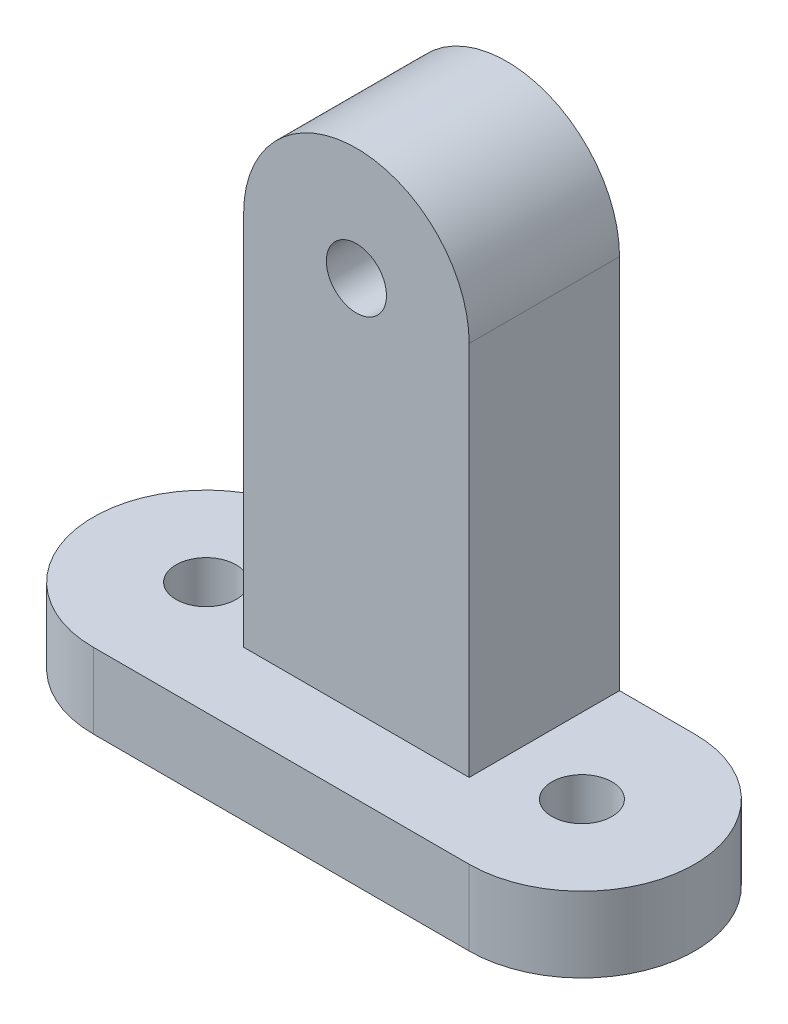
ISO-10303-21;
HEADER;
FILE_DESCRIPTION(('STEP AP214'),'2;1');
FILE_NAME('part.step','',(''),(''),'','','');
FILE_SCHEMA(('AUTOMOTIVE_DESIGN { 1 0 10303 214 1 1 1 1 }'));
ENDSEC;
DATA;
#1=APPLICATION_CONTEXT('core data for automotive mechanical design processes');
#2=APPLICATION_PROTOCOL_DEFINITION('international standard','automotive_design',2000,#1);
#3=PRODUCT_CONTEXT('',#1,'mechanical');
#4=PRODUCT('Part','Part','',(#3));
#5=PRODUCT_RELATED_PRODUCT_CATEGORY('part','',(#4));
#6=PRODUCT_DEFINITION_FORMATION('','',#4);
#7=PRODUCT_DEFINITION_CONTEXT('part definition',#1,'design');
#8=PRODUCT_DEFINITION('design','',#6,#7);
#9=PRODUCT_DEFINITION_SHAPE('','',#8);
#10=(LENGTH_UNIT() NAMED_UNIT(*) SI_UNIT(.MILLI.,.METRE.));
#11=(NAMED_UNIT(*) PLANE_ANGLE_UNIT() SI_UNIT($,.RADIAN.));
#12=(NAMED_UNIT(*) SI_UNIT($,.STERADIAN.) SOLID_ANGLE_UNIT());
#13=UNCERTAINTY_MEASURE_WITH_UNIT(LENGTH_MEASURE(1.E-05),#10,'distance_accuracy_value','');
#14=(GEOMETRIC_REPRESENTATION_CONTEXT(3) GLOBAL_UNCERTAINTY_ASSIGNED_CONTEXT((#13)) GLOBAL_UNIT_ASSIGNED_CONTEXT((#10,
#11,#12)) REPRESENTATION_CONTEXT('',''));
#15=CARTESIAN_POINT('',(0.,0.,0.));
#16=DIRECTION('',(0.,0.,1.));
#17=DIRECTION('',(1.,0.,0.));
#18=AXIS2_PLACEMENT_3D('',#15,#16,#17);
#19=CARTESIAN_POINT('',(0.,5.,-7.5));
#20=DIRECTION('',(0.,1.,0.));
#21=DIRECTION('',(0.,0.,1.));
#22=AXIS2_PLACEMENT_3D('',#19,#20,#21);
#23=PLANE('',#22);
#24=DIRECTION('',(0.,0.,-1.));
#25=VECTOR('',#24,1.);
#26=CARTESIAN_POINT('',(20.,5.,-5.));
#27=LINE('',#26,#25);
#28=CARTESIAN_POINT('',(20.,5.,-5.));
#29=VERTEX_POINT('',#28);
#30=CARTESIAN_POINT('',(20.,5.,-15.));
#31=VERTEX_POINT('',#30);
#32=EDGE_CURVE('E123',#29,#31,#27,.T.);
#33=ORIENTED_EDGE('',*,*,#32,.F.);
#34=DIRECTION('',(-1.,0.,0.));
#35=VECTOR('',#34,1.);
#36=CARTESIAN_POINT('',(20.,5.,-5.));
#37=LINE('',#36,#35);
#38=CARTESIAN_POINT('',(4.99999999999999,5.,-5.));
#39=VERTEX_POINT('',#38);
#40=EDGE_CURVE('E110',#29,#39,#37,.T.);
#41=ORIENTED_EDGE('',*,*,#40,.T.);
#42=DIRECTION('',(0.,0.,-1.));
#43=VECTOR('',#42,1.);
#44=CARTESIAN_POINT('',(4.99999999999999,5.,-5.));
#45=LINE('',#44,#43);
#46=CARTESIAN_POINT('',(4.99999999999999,5.,-15.));
#47=VERTEX_POINT('',#46);
#48=EDGE_CURVE('E132',#39,#47,#45,.T.);
#49=ORIENTED_EDGE('',*,*,#48,.T.);
#50=DIRECTION('',(-1.,0.,0.));
#51=VECTOR('',#50,1.);
#52=CARTESIAN_POINT('',(0.,5.,-15.));
#53=LINE('',#52,#51);
#54=CARTESIAN_POINT('',(0.,5.,-15.));
#55=VERTEX_POINT('',#54);
#56=EDGE_CURVE('E58',#47,#55,#53,.T.);
#57=ORIENTED_EDGE('',*,*,#56,.T.);
#58=CARTESIAN_POINT('',(0.,5.,-7.5));
#59=DIRECTION('',(0.,1.,0.));
#60=DIRECTION('',(0.,0.,1.));
#61=AXIS2_PLACEMENT_3D('',#58,#59,#60);
#62=CIRCLE('',#61,7.5);
#63=CARTESIAN_POINT('',(0.,5.,0.));
#64=VERTEX_POINT('',#63);
#65=EDGE_CURVE('E153',#55,#64,#62,.T.);
#66=ORIENTED_EDGE('',*,*,#65,.T.);
#67=DIRECTION('',(1.,0.,0.));
#68=VECTOR('',#67,1.);
#69=CARTESIAN_POINT('',(0.,5.,0.));
#70=LINE('',#69,#68);
#71=CARTESIAN_POINT('',(25.,5.,0.));
#72=VERTEX_POINT('',#71);
#73=EDGE_CURVE('E87',#64,#72,#70,.T.);
#74=ORIENTED_EDGE('',*,*,#73,.T.);
#75=CARTESIAN_POINT('',(25.,5.,-7.5));
#76=DIRECTION('',(0.,1.,0.));
#77=DIRECTION('',(0.,0.,-1.));
#78=AXIS2_PLACEMENT_3D('',#75,#76,#77);
#79=CIRCLE('',#78,7.5);
#80=CARTESIAN_POINT('',(25.,5.,-15.));
#81=VERTEX_POINT('',#80);
#82=EDGE_CURVE('E156',#72,#81,#79,.T.);
#83=ORIENTED_EDGE('',*,*,#82,.T.);
#84=EDGE_CURVE('E131',#81,#31,#53,.T.);
#85=ORIENTED_EDGE('',*,*,#84,.T.);
#86=EDGE_LOOP('',(#33,#41,#49,#57,#66,#74,#83,#85));
#87=FACE_BOUND('',#86,.T.);
#88=CARTESIAN_POINT('',(0.,5.,-7.5));
#89=DIRECTION('',(0.,1.,0.));
#90=DIRECTION('',(0.,0.,1.));
#91=AXIS2_PLACEMENT_3D('',#88,#89,#90);
#92=CIRCLE('',#91,2.);
#93=CARTESIAN_POINT('',(0.,5.,-5.5));
#94=VERTEX_POINT('',#93);
#95=EDGE_CURVE('E147',#94,#94,#92,.T.);
#96=ORIENTED_EDGE('',*,*,#95,.F.);
#97=EDGE_LOOP('',(#96));
#98=FACE_BOUND('',#97,.T.);
#99=CARTESIAN_POINT('',(25.,5.,-7.5));
#100=DIRECTION('',(0.,1.,0.));
#101=DIRECTION('',(0.,0.,1.));
#102=AXIS2_PLACEMENT_3D('',#99,#100,#101);
#103=CIRCLE('',#102,2.);
#104=CARTESIAN_POINT('',(25.,5.,-5.5));
#105=VERTEX_POINT('',#104);
#106=EDGE_CURVE('E140',#105,#105,#103,.T.);
#107=ORIENTED_EDGE('',*,*,#106,.F.);
#108=EDGE_LOOP('',(#107));
#109=FACE_BOUND('',#108,.T.);
#110=ADVANCED_FACE('F35',(#87,#98,#109),#23,.T.);
#111=CARTESIAN_POINT('',(0.,0.,-7.5));
#112=DIRECTION('',(0.,1.,0.));
#113=DIRECTION('',(0.,0.,1.));
#114=AXIS2_PLACEMENT_3D('',#111,#112,#113);
#115=PLANE('',#114);
#116=CARTESIAN_POINT('',(0.,0.,-7.5));
#117=DIRECTION('',(0.,1.,0.));
#118=DIRECTION('',(0.,0.,1.));
#119=AXIS2_PLACEMENT_3D('',#116,#117,#118);
#120=CIRCLE('',#119,7.5);
#121=CARTESIAN_POINT('',(0.,0.,-15.));
#122=VERTEX_POINT('',#121);
#123=CARTESIAN_POINT('',(0.,0.,0.));
#124=VERTEX_POINT('',#123);
#125=EDGE_CURVE('E150',#122,#124,#120,.T.);
#126=ORIENTED_EDGE('',*,*,#125,.F.);
#127=DIRECTION('',(-1.,0.,0.));
#128=VECTOR('',#127,1.);
#129=CARTESIAN_POINT('',(0.,0.,-15.));
#130=LINE('',#129,#128);
#131=CARTESIAN_POINT('',(25.,0.,-15.));
#132=VERTEX_POINT('',#131);
#133=EDGE_CURVE('E80',#132,#122,#130,.T.);
#134=ORIENTED_EDGE('',*,*,#133,.F.);
#135=CARTESIAN_POINT('',(25.,0.,-7.5));
#136=DIRECTION('',(0.,1.,0.));
#137=DIRECTION('',(0.,0.,-1.));
#138=AXIS2_PLACEMENT_3D('',#135,#136,#137);
#139=CIRCLE('',#138,7.5);
#140=CARTESIAN_POINT('',(25.,0.,0.));
#141=VERTEX_POINT('',#140);
#142=EDGE_CURVE('E164',#141,#132,#139,.T.);
#143=ORIENTED_EDGE('',*,*,#142,.F.);
#144=DIRECTION('',(1.,0.,0.));
#145=VECTOR('',#144,1.);
#146=CARTESIAN_POINT('',(0.,0.,0.));
#147=LINE('',#146,#145);
#148=EDGE_CURVE('E162',#124,#141,#147,.T.);
#149=ORIENTED_EDGE('',*,*,#148,.F.);
#150=EDGE_LOOP('',(#126,#134,#143,#149));
#151=FACE_BOUND('',#150,.T.);
#152=CARTESIAN_POINT('',(0.,0.,-7.5));
#153=DIRECTION('',(0.,1.,0.));
#154=DIRECTION('',(0.,0.,1.));
#155=AXIS2_PLACEMENT_3D('',#152,#153,#154);
#156=CIRCLE('',#155,2.);
#157=CARTESIAN_POINT('',(0.,0.,-5.5));
#158=VERTEX_POINT('',#157);
#159=EDGE_CURVE('E143',#158,#158,#156,.T.);
#160=ORIENTED_EDGE('',*,*,#159,.T.);
#161=EDGE_LOOP('',(#160));
#162=FACE_BOUND('',#161,.T.);
#163=CARTESIAN_POINT('',(25.,0.,-7.5));
#164=DIRECTION('',(0.,1.,0.));
#165=DIRECTION('',(0.,0.,1.));
#166=AXIS2_PLACEMENT_3D('',#163,#164,#165);
#167=CIRCLE('',#166,2.);
#168=CARTESIAN_POINT('',(25.,0.,-5.5));
#169=VERTEX_POINT('',#168);
#170=EDGE_CURVE('E144',#169,#169,#167,.T.);
#171=ORIENTED_EDGE('',*,*,#170,.T.);
#172=EDGE_LOOP('',(#171));
#173=FACE_BOUND('',#172,.T.);
#174=ADVANCED_FACE('F177',(#151,#162,#173),#115,.F.);
#175=CARTESIAN_POINT('',(0.,5.,-7.5));
#176=DIRECTION('',(0.,-1.,0.));
#177=DIRECTION('',(0.,0.,-1.));
#178=AXIS2_PLACEMENT_3D('',#175,#176,#177);
#179=CYLINDRICAL_SURFACE('',#178,7.5);
#180=ORIENTED_EDGE('',*,*,#125,.T.);
#181=DIRECTION('',(0.,-1.,0.));
#182=VECTOR('',#181,1.);
#183=CARTESIAN_POINT('',(0.,5.,0.));
#184=LINE('',#183,#182);
#185=EDGE_CURVE('E11',#64,#124,#184,.T.);
#186=ORIENTED_EDGE('',*,*,#185,.F.);
#187=ORIENTED_EDGE('',*,*,#65,.F.);
#188=DIRECTION('',(0.,-1.,0.));
#189=VECTOR('',#188,1.);
#190=CARTESIAN_POINT('',(0.,5.,-15.));
#191=LINE('',#190,#189);
#192=EDGE_CURVE('E159',#55,#122,#191,.T.);
#193=ORIENTED_EDGE('',*,*,#192,.T.);
#194=EDGE_LOOP('',(#180,#186,#187,#193));
#195=FACE_BOUND('',#194,.T.);
#196=ADVANCED_FACE('F37',(#195),#179,.T.);
#197=CARTESIAN_POINT('',(0.,5.,0.));
#198=DIRECTION('',(0.,0.,-1.));
#199=DIRECTION('',(-1.,0.,0.));
#200=AXIS2_PLACEMENT_3D('',#197,#198,#199);
#201=PLANE('',#200);
#202=ORIENTED_EDGE('',*,*,#148,.T.);
#203=DIRECTION('',(0.,-1.,0.));
#204=VECTOR('',#203,1.);
#205=CARTESIAN_POINT('',(25.,5.,0.));
#206=LINE('',#205,#204);
#207=EDGE_CURVE('E43',#72,#141,#206,.T.);
#208=ORIENTED_EDGE('',*,*,#207,.F.);
#209=ORIENTED_EDGE('',*,*,#73,.F.);
#210=ORIENTED_EDGE('',*,*,#185,.T.);
#211=EDGE_LOOP('',(#202,#208,#209,#210));
#212=FACE_BOUND('',#211,.T.);
#213=ADVANCED_FACE('F216',(#212),#201,.F.);
#214=CARTESIAN_POINT('',(25.,5.,-7.5));
#215=DIRECTION('',(0.,-1.,0.));
#216=DIRECTION('',(0.,0.,-1.));
#217=AXIS2_PLACEMENT_3D('',#214,#215,#216);
#218=CYLINDRICAL_SURFACE('',#217,7.5);
#219=ORIENTED_EDGE('',*,*,#142,.T.);
#220=DIRECTION('',(0.,-1.,0.));
#221=VECTOR('',#220,1.);
#222=CARTESIAN_POINT('',(25.,5.,-15.));
#223=LINE('',#222,#221);
#224=EDGE_CURVE('E168',#81,#132,#223,.T.);
#225=ORIENTED_EDGE('',*,*,#224,.F.);
#226=ORIENTED_EDGE('',*,*,#82,.F.);
#227=ORIENTED_EDGE('',*,*,#207,.T.);
#228=EDGE_LOOP('',(#219,#225,#226,#227));
#229=FACE_BOUND('',#228,.T.);
#230=ADVANCED_FACE('F173',(#229),#218,.T.);
#231=CARTESIAN_POINT('',(0.,5.,-15.));
#232=DIRECTION('',(0.,0.,1.));
#233=DIRECTION('',(1.,0.,0.));
#234=AXIS2_PLACEMENT_3D('',#231,#232,#233);
#235=PLANE('',#234);
#236=ORIENTED_EDGE('',*,*,#133,.T.);
#237=ORIENTED_EDGE('',*,*,#192,.F.);
#238=ORIENTED_EDGE('',*,*,#56,.F.);
#239=DIRECTION('',(0.,1.,0.));
#240=VECTOR('',#239,1.);
#241=CARTESIAN_POINT('',(4.99999999999999,5.,-15.));
#242=LINE('',#241,#240);
#243=CARTESIAN_POINT('',(5.,30.,-15.));
#244=VERTEX_POINT('',#243);
#245=EDGE_CURVE('E50',#47,#244,#242,.T.);
#246=ORIENTED_EDGE('',*,*,#245,.T.);
#247=CARTESIAN_POINT('',(12.5,30.,-15.));
#248=DIRECTION('',(0.,0.,-1.));
#249=DIRECTION('',(1.,0.,0.));
#250=AXIS2_PLACEMENT_3D('',#247,#248,#249);
#251=CIRCLE('',#250,7.5);
#252=CARTESIAN_POINT('',(20.,30.,-15.));
#253=VERTEX_POINT('',#252);
#254=EDGE_CURVE('E126',#244,#253,#251,.T.);
#255=ORIENTED_EDGE('',*,*,#254,.T.);
#256=DIRECTION('',(0.,-1.,0.));
#257=VECTOR('',#256,1.);
#258=CARTESIAN_POINT('',(20.,5.,-15.));
#259=LINE('',#258,#257);
#260=EDGE_CURVE('E186',#253,#31,#259,.T.);
#261=ORIENTED_EDGE('',*,*,#260,.T.);
#262=ORIENTED_EDGE('',*,*,#84,.F.);
#263=ORIENTED_EDGE('',*,*,#224,.T.);
#264=EDGE_LOOP('',(#236,#237,#238,#246,#255,#261,#262,#263));
#265=FACE_BOUND('',#264,.T.);
#266=CARTESIAN_POINT('',(12.5,30.,-15.));
#267=DIRECTION('',(0.,0.,-1.));
#268=DIRECTION('',(-1.,0.,0.));
#269=AXIS2_PLACEMENT_3D('',#266,#267,#268);
#270=CIRCLE('',#269,2.00000000000001);
#271=CARTESIAN_POINT('',(10.5,30.,-15.));
#272=VERTEX_POINT('',#271);
#273=EDGE_CURVE('E197',#272,#272,#270,.T.);
#274=ORIENTED_EDGE('',*,*,#273,.F.);
#275=EDGE_LOOP('',(#274));
#276=FACE_BOUND('',#275,.T.);
#277=ADVANCED_FACE('F182',(#265,#276),#235,.F.);
#278=CARTESIAN_POINT('',(0.,5.,-7.5));
#279=DIRECTION('',(0.,-1.,0.));
#280=DIRECTION('',(0.,0.,-1.));
#281=AXIS2_PLACEMENT_3D('',#278,#279,#280);
#282=CYLINDRICAL_SURFACE('',#281,2.);
#283=ORIENTED_EDGE('',*,*,#95,.T.);
#284=EDGE_LOOP('',(#283));
#285=FACE_BOUND('',#284,.T.);
#286=ORIENTED_EDGE('',*,*,#159,.F.);
#287=EDGE_LOOP('',(#286));
#288=FACE_BOUND('',#287,.T.);
#289=ADVANCED_FACE('F207',(#285,#288),#282,.F.);
#290=CARTESIAN_POINT('',(25.,5.,-7.5));
#291=DIRECTION('',(0.,-1.,0.));
#292=DIRECTION('',(0.,0.,-1.));
#293=AXIS2_PLACEMENT_3D('',#290,#291,#292);
#294=CYLINDRICAL_SURFACE('',#293,2.);
#295=ORIENTED_EDGE('',*,*,#106,.T.);
#296=EDGE_LOOP('',(#295));
#297=FACE_BOUND('',#296,.T.);
#298=ORIENTED_EDGE('',*,*,#170,.F.);
#299=EDGE_LOOP('',(#298));
#300=FACE_BOUND('',#299,.T.);
#301=ADVANCED_FACE('F213',(#297,#300),#294,.F.);
#302=CARTESIAN_POINT('',(20.,5.,-5.));
#303=DIRECTION('',(1.,0.,0.));
#304=DIRECTION('',(0.,0.,-1.));
#305=AXIS2_PLACEMENT_3D('',#302,#303,#304);
#306=PLANE('',#305);
#307=ORIENTED_EDGE('',*,*,#260,.F.);
#308=DIRECTION('',(0.,0.,-1.));
#309=VECTOR('',#308,1.);
#310=CARTESIAN_POINT('',(20.,30.,-5.));
#311=LINE('',#310,#309);
#312=CARTESIAN_POINT('',(20.,30.,-5.));
#313=VERTEX_POINT('',#312);
#314=EDGE_CURVE('E125',#313,#253,#311,.T.);
#315=ORIENTED_EDGE('',*,*,#314,.F.);
#316=DIRECTION('',(0.,-1.,0.));
#317=VECTOR('',#316,1.);
#318=CARTESIAN_POINT('',(20.,5.,-5.));
#319=LINE('',#318,#317);
#320=EDGE_CURVE('E114',#313,#29,#319,.T.);
#321=ORIENTED_EDGE('',*,*,#320,.T.);
#322=ORIENTED_EDGE('',*,*,#32,.T.);
#323=EDGE_LOOP('',(#307,#315,#321,#322));
#324=FACE_BOUND('',#323,.T.);
#325=ADVANCED_FACE('F122',(#324),#306,.T.);
#326=CARTESIAN_POINT('',(12.5,30.,-5.));
#327=DIRECTION('',(0.,0.,-1.));
#328=DIRECTION('',(-1.,0.,0.));
#329=AXIS2_PLACEMENT_3D('',#326,#327,#328);
#330=CYLINDRICAL_SURFACE('',#329,7.5);
#331=ORIENTED_EDGE('',*,*,#254,.F.);
#332=DIRECTION('',(0.,0.,-1.));
#333=VECTOR('',#332,1.);
#334=CARTESIAN_POINT('',(5.,30.,-5.));
#335=LINE('',#334,#333);
#336=CARTESIAN_POINT('',(5.,30.,-5.));
#337=VERTEX_POINT('',#336);
#338=EDGE_CURVE('E135',#337,#244,#335,.T.);
#339=ORIENTED_EDGE('',*,*,#338,.F.);
#340=CARTESIAN_POINT('',(12.5,30.,-5.));
#341=DIRECTION('',(0.,0.,-1.));
#342=DIRECTION('',(1.,0.,0.));
#343=AXIS2_PLACEMENT_3D('',#340,#341,#342);
#344=CIRCLE('',#343,7.5);
#345=EDGE_CURVE('E133',#337,#313,#344,.T.);
#346=ORIENTED_EDGE('',*,*,#345,.T.);
#347=ORIENTED_EDGE('',*,*,#314,.T.);
#348=EDGE_LOOP('',(#331,#339,#346,#347));
#349=FACE_BOUND('',#348,.T.);
#350=ADVANCED_FACE('F189',(#349),#330,.T.);
#351=CARTESIAN_POINT('',(4.99999999999999,5.,-5.));
#352=DIRECTION('',(-1.,0.,0.));
#353=DIRECTION('',(0.,-1.,0.));
#354=AXIS2_PLACEMENT_3D('',#351,#352,#353);
#355=PLANE('',#354);
#356=ORIENTED_EDGE('',*,*,#245,.F.);
#357=ORIENTED_EDGE('',*,*,#48,.F.);
#358=DIRECTION('',(0.,1.,0.));
#359=VECTOR('',#358,1.);
#360=CARTESIAN_POINT('',(4.99999999999999,5.,-5.));
#361=LINE('',#360,#359);
#362=EDGE_CURVE('E117',#39,#337,#361,.T.);
#363=ORIENTED_EDGE('',*,*,#362,.T.);
#364=ORIENTED_EDGE('',*,*,#338,.T.);
#365=EDGE_LOOP('',(#356,#357,#363,#364));
#366=FACE_BOUND('',#365,.T.);
#367=ADVANCED_FACE('F193',(#366),#355,.T.);
#368=CARTESIAN_POINT('',(12.5,30.,-5.));
#369=DIRECTION('',(0.,0.,1.));
#370=DIRECTION('',(1.,0.,0.));
#371=AXIS2_PLACEMENT_3D('',#368,#369,#370);
#372=PLANE('',#371);
#373=CARTESIAN_POINT('',(12.5,30.,-5.));
#374=DIRECTION('',(0.,0.,-1.));
#375=DIRECTION('',(-1.,0.,0.));
#376=AXIS2_PLACEMENT_3D('',#373,#374,#375);
#377=CIRCLE('',#376,2.00000000000001);
#378=CARTESIAN_POINT('',(10.5,30.,-5.));
#379=VERTEX_POINT('',#378);
#380=EDGE_CURVE('E195',#379,#379,#377,.T.);
#381=ORIENTED_EDGE('',*,*,#380,.T.);
#382=EDGE_LOOP('',(#381));
#383=FACE_BOUND('',#382,.T.);
#384=ORIENTED_EDGE('',*,*,#320,.F.);
#385=ORIENTED_EDGE('',*,*,#345,.F.);
#386=ORIENTED_EDGE('',*,*,#362,.F.);
#387=ORIENTED_EDGE('',*,*,#40,.F.);
#388=EDGE_LOOP('',(#384,#385,#386,#387));
#389=FACE_BOUND('',#388,.T.);
#390=ADVANCED_FACE('F112',(#383,#389),#372,.T.);
#391=CARTESIAN_POINT('',(12.5,30.,-5.));
#392=DIRECTION('',(0.,0.,-1.));
#393=DIRECTION('',(-1.,0.,0.));
#394=AXIS2_PLACEMENT_3D('',#391,#392,#393);
#395=CYLINDRICAL_SURFACE('',#394,2.00000000000001);
#396=ORIENTED_EDGE('',*,*,#380,.F.);
#397=EDGE_LOOP('',(#396));
#398=FACE_BOUND('',#397,.T.);
#399=ORIENTED_EDGE('',*,*,#273,.T.);
#400=EDGE_LOOP('',(#399));
#401=FACE_BOUND('',#400,.T.);
#402=ADVANCED_FACE('F205',(#398,#401),#395,.F.);
#403=CLOSED_SHELL('',(#110,#174,#196,#213,#230,#277,#289,#301,#325,#350,#367,#390,#402));
#404=MANIFOLD_SOLID_BREP('B2',#403);
#405=ADVANCED_BREP_SHAPE_REPRESENTATION('',(#18,#404),#14);
#406=SHAPE_DEFINITION_REPRESENTATION(#9,#405);
ENDSEC;
END-ISO-10303-21;
